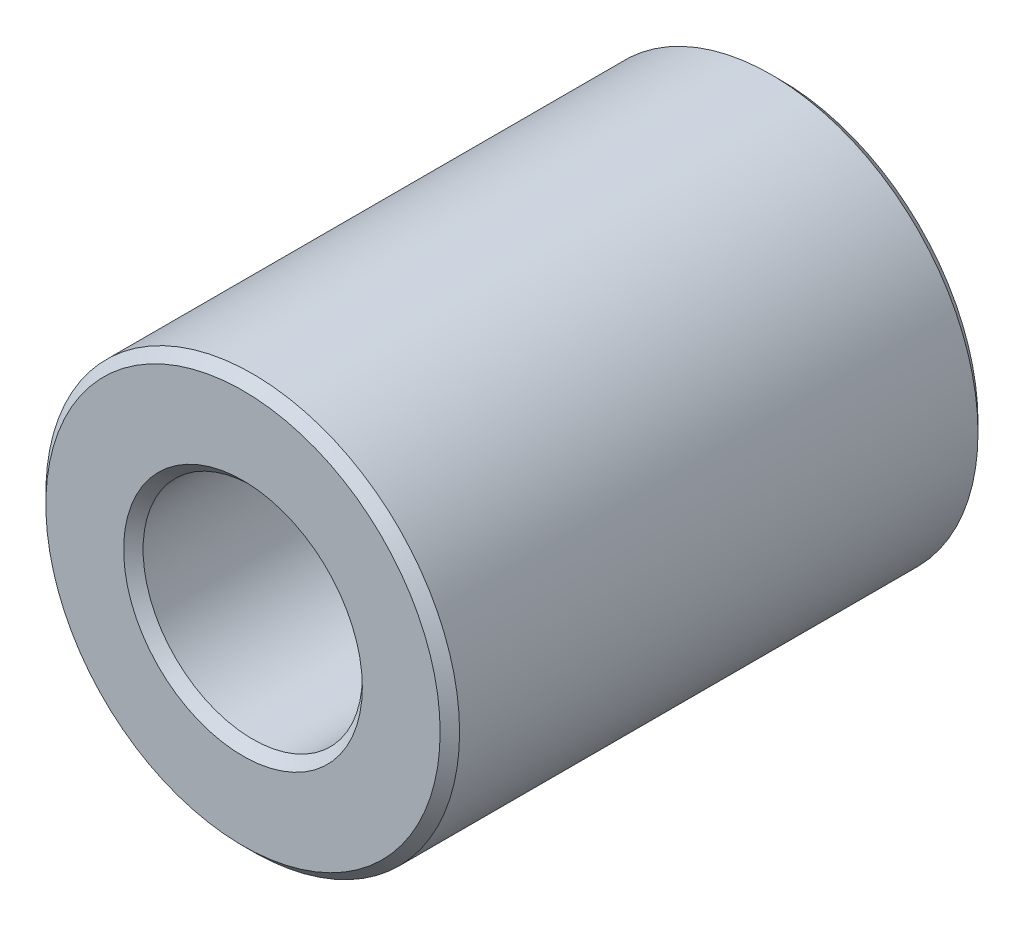
ISO-10303-21;
HEADER;
FILE_DESCRIPTION(('STEP AP214'),'2;1');
FILE_NAME('part.step','',(''),(''),'','','');
FILE_SCHEMA(('AUTOMOTIVE_DESIGN { 1 0 10303 214 1 1 1 1 }'));
ENDSEC;
DATA;
#1=APPLICATION_CONTEXT('core data for automotive mechanical design processes');
#2=APPLICATION_PROTOCOL_DEFINITION('international standard','automotive_design',2000,#1);
#3=PRODUCT_CONTEXT('',#1,'mechanical');
#4=PRODUCT('Part','Part','',(#3));
#5=PRODUCT_RELATED_PRODUCT_CATEGORY('part','',(#4));
#6=PRODUCT_DEFINITION_FORMATION('','',#4);
#7=PRODUCT_DEFINITION_CONTEXT('part definition',#1,'design');
#8=PRODUCT_DEFINITION('design','',#6,#7);
#9=PRODUCT_DEFINITION_SHAPE('','',#8);
#10=(LENGTH_UNIT() NAMED_UNIT(*) SI_UNIT(.MILLI.,.METRE.));
#11=(NAMED_UNIT(*) PLANE_ANGLE_UNIT() SI_UNIT($,.RADIAN.));
#12=(NAMED_UNIT(*) SI_UNIT($,.STERADIAN.) SOLID_ANGLE_UNIT());
#13=UNCERTAINTY_MEASURE_WITH_UNIT(LENGTH_MEASURE(1.E-05),#10,'distance_accuracy_value','');
#14=(GEOMETRIC_REPRESENTATION_CONTEXT(3) GLOBAL_UNCERTAINTY_ASSIGNED_CONTEXT((#13)) GLOBAL_UNIT_ASSIGNED_CONTEXT((#10,
#11,#12)) REPRESENTATION_CONTEXT('',''));
#15=CARTESIAN_POINT('',(0.,0.,0.));
#16=DIRECTION('',(0.,0.,1.));
#17=DIRECTION('',(1.,0.,0.));
#18=AXIS2_PLACEMENT_3D('',#15,#16,#17);
#19=CARTESIAN_POINT('',(0.,0.,-6.5));
#20=DIRECTION('',(0.,0.,1.));
#21=DIRECTION('',(1.,0.,0.));
#22=AXIS2_PLACEMENT_3D('',#19,#20,#21);
#23=CYLINDRICAL_SURFACE('',#22,5.);
#24=CARTESIAN_POINT('',(0.,0.,6.26500000000001));
#25=DIRECTION('',(0.,0.,1.));
#26=DIRECTION('',(1.,0.,0.));
#27=AXIS2_PLACEMENT_3D('',#24,#25,#26);
#28=CIRCLE('',#27,5.);
#29=CARTESIAN_POINT('',(5.,0.,6.265));
#30=VERTEX_POINT('',#29);
#31=EDGE_CURVE('E57',#30,#30,#28,.F.);
#32=CARTESIAN_POINT('',(0.,0.,-6.265));
#33=DIRECTION('',(0.,0.,1.));
#34=DIRECTION('',(1.,0.,0.));
#35=AXIS2_PLACEMENT_3D('',#32,#33,#34);
#36=CIRCLE('',#35,5.);
#37=CARTESIAN_POINT('',(5.,0.,-6.265));
#38=VERTEX_POINT('',#37);
#39=EDGE_CURVE('E60',#38,#38,#36,.T.);
#40=CARTESIAN_POINT('',(5.,0.,6.265));
#41=CARTESIAN_POINT('',(5.,0.,6.13447916666667));
#42=CARTESIAN_POINT('',(5.,0.,6.00395833333334));
#43=CARTESIAN_POINT('',(5.,0.,5.74291666666667));
#44=CARTESIAN_POINT('',(5.,0.,5.61239583333334));
#45=CARTESIAN_POINT('',(5.,0.,5.35135416666667));
#46=CARTESIAN_POINT('',(5.,0.,5.22083333333334));
#47=CARTESIAN_POINT('',(5.,0.,4.95979166666667));
#48=CARTESIAN_POINT('',(5.,0.,4.82927083333334));
#49=CARTESIAN_POINT('',(5.,0.,4.56822916666667));
#50=CARTESIAN_POINT('',(5.,0.,4.43770833333334));
#51=CARTESIAN_POINT('',(5.,0.,4.17666666666667));
#52=CARTESIAN_POINT('',(5.,0.,4.04614583333334));
#53=CARTESIAN_POINT('',(5.,0.,3.78510416666667));
#54=CARTESIAN_POINT('',(5.,0.,3.65458333333334));
#55=CARTESIAN_POINT('',(5.,0.,3.39354166666667));
#56=CARTESIAN_POINT('',(5.,0.,3.26302083333334));
#57=CARTESIAN_POINT('',(5.,0.,3.00197916666667));
#58=CARTESIAN_POINT('',(5.,0.,2.87145833333334));
#59=CARTESIAN_POINT('',(5.,0.,2.61041666666667));
#60=CARTESIAN_POINT('',(5.,0.,2.47989583333334));
#61=CARTESIAN_POINT('',(5.,0.,2.21885416666667));
#62=CARTESIAN_POINT('',(5.,0.,2.08833333333334));
#63=CARTESIAN_POINT('',(5.,0.,1.82729166666667));
#64=CARTESIAN_POINT('',(5.,0.,1.69677083333334));
#65=CARTESIAN_POINT('',(5.,0.,1.43572916666667));
#66=CARTESIAN_POINT('',(5.,0.,1.30520833333334));
#67=CARTESIAN_POINT('',(5.,0.,1.04416666666667));
#68=CARTESIAN_POINT('',(5.,0.,0.913645833333338));
#69=CARTESIAN_POINT('',(5.,0.,0.652604166666671));
#70=CARTESIAN_POINT('',(5.,0.,0.522083333333338));
#71=CARTESIAN_POINT('',(5.,0.,0.261041666666671));
#72=CARTESIAN_POINT('',(5.,0.,0.130520833333338));
#73=CARTESIAN_POINT('',(5.,0.,-0.130520833333329));
#74=CARTESIAN_POINT('',(5.,0.,-0.261041666666663));
#75=CARTESIAN_POINT('',(5.,0.,-0.522083333333329));
#76=CARTESIAN_POINT('',(5.,0.,-0.652604166666662));
#77=CARTESIAN_POINT('',(5.,0.,-0.913645833333329));
#78=CARTESIAN_POINT('',(5.,0.,-1.04416666666666));
#79=CARTESIAN_POINT('',(5.,0.,-1.30520833333333));
#80=CARTESIAN_POINT('',(5.,0.,-1.43572916666666));
#81=CARTESIAN_POINT('',(5.,0.,-1.69677083333333));
#82=CARTESIAN_POINT('',(5.,0.,-1.82729166666666));
#83=CARTESIAN_POINT('',(5.,0.,-2.08833333333333));
#84=CARTESIAN_POINT('',(5.,0.,-2.21885416666666));
#85=CARTESIAN_POINT('',(5.,0.,-2.47989583333333));
#86=CARTESIAN_POINT('',(5.,0.,-2.61041666666666));
#87=CARTESIAN_POINT('',(5.,0.,-2.87145833333333));
#88=CARTESIAN_POINT('',(5.,0.,-3.00197916666666));
#89=CARTESIAN_POINT('',(5.,0.,-3.26302083333333));
#90=CARTESIAN_POINT('',(5.,0.,-3.39354166666666));
#91=CARTESIAN_POINT('',(5.,0.,-3.65458333333333));
#92=CARTESIAN_POINT('',(5.,0.,-3.78510416666666));
#93=CARTESIAN_POINT('',(5.,0.,-4.04614583333333));
#94=CARTESIAN_POINT('',(5.,0.,-4.17666666666666));
#95=CARTESIAN_POINT('',(5.,0.,-4.43770833333333));
#96=CARTESIAN_POINT('',(5.,0.,-4.56822916666666));
#97=CARTESIAN_POINT('',(5.,0.,-4.82927083333333));
#98=CARTESIAN_POINT('',(5.,0.,-4.95979166666666));
#99=CARTESIAN_POINT('',(5.,0.,-5.22083333333333));
#100=CARTESIAN_POINT('',(5.,0.,-5.35135416666666));
#101=CARTESIAN_POINT('',(5.,0.,-5.61239583333333));
#102=CARTESIAN_POINT('',(5.,0.,-5.74291666666666));
#103=CARTESIAN_POINT('',(5.,0.,-6.00395833333333));
#104=CARTESIAN_POINT('',(5.,0.,-6.13447916666666));
#105=CARTESIAN_POINT('',(5.,0.,-6.265));
#106=B_SPLINE_CURVE_WITH_KNOTS('',3,(#40,#41,#42,#43,#44,#45,#46,#47,#48,#49,#50,#51,#52,#53,
#54,#55,#56,#57,#58,#59,#60,#61,#62,#63,#64,#65,#66,#67,#68,#69,#70,#71,#72,#73,#74,#75,#76,#77,
#78,#79,#80,#81,#82,#83,#84,#85,#86,#87,#88,#89,#90,#91,#92,#93,#94,#95,#96,#97,#98,#99,#100,
#101,#102,#103,#104,#105),.UNSPECIFIED.,.F.,.F.,(4,2,2,2,2,2,2,2,2,2,2,2,2,2,2,2,2,2,2,2,2,2,2,
2,2,2,2,2,2,2,2,2,4),(0.,0.3915625,0.783125000000001,1.1746875,1.56625,1.9578125,2.349375,
2.7409375,3.1325,3.5240625,3.915625,4.3071875,4.69875,5.0903125,5.481875,5.8734375,6.265,
6.6565625,7.048125,7.4396875,7.83125,8.2228125,8.614375,9.0059375,9.3975,9.7890625,10.180625,
10.5721875,10.96375,11.3553125,11.746875,12.1384375,12.53),.UNSPECIFIED.);
#107=EDGE_CURVE('BSEAM37',#30,#38,#106,.T.);
#108=ORIENTED_EDGE('',*,*,#31,.T.);
#109=ORIENTED_EDGE('',*,*,#39,.T.);
#110=ORIENTED_EDGE('',*,*,#107,.T.);
#111=ORIENTED_EDGE('',*,*,#107,.F.);
#112=EDGE_LOOP('',(#108,#110,#109,#111));
#113=FACE_BOUND('',#112,.T.);
#114=ADVANCED_FACE('F37',(#113),#23,.T.);
#115=CARTESIAN_POINT('',(0.,0.,-6.5));
#116=DIRECTION('',(0.,0.,1.));
#117=DIRECTION('',(1.,0.,0.));
#118=AXIS2_PLACEMENT_3D('',#115,#116,#117);
#119=PLANE('',#118);
#120=CARTESIAN_POINT('',(0.,0.,-6.5));
#121=DIRECTION('',(0.,0.,1.));
#122=DIRECTION('',(1.,0.,0.));
#123=AXIS2_PLACEMENT_3D('',#120,#121,#122);
#124=CIRCLE('',#123,4.76499999999999);
#125=CARTESIAN_POINT('',(4.76499999999999,0.,-6.5));
#126=VERTEX_POINT('',#125);
#127=EDGE_CURVE('E48',#126,#126,#124,.F.);
#128=ORIENTED_EDGE('',*,*,#127,.T.);
#129=EDGE_LOOP('',(#128));
#130=FACE_BOUND('',#129,.T.);
#131=CARTESIAN_POINT('',(0.,0.,-6.5));
#132=DIRECTION('',(0.,0.,1.));
#133=DIRECTION('',(1.,0.,0.));
#134=AXIS2_PLACEMENT_3D('',#131,#132,#133);
#135=CIRCLE('',#134,2.88499999999999);
#136=CARTESIAN_POINT('',(2.88499999999999,0.,-6.5));
#137=VERTEX_POINT('',#136);
#138=EDGE_CURVE('E52',#137,#137,#135,.T.);
#139=ORIENTED_EDGE('',*,*,#138,.T.);
#140=EDGE_LOOP('',(#139));
#141=FACE_BOUND('',#140,.T.);
#142=ADVANCED_FACE('F85',(#130,#141),#119,.F.);
#143=CARTESIAN_POINT('',(0.,0.,-6.5));
#144=DIRECTION('',(0.,0.,1.));
#145=DIRECTION('',(1.,0.,0.));
#146=AXIS2_PLACEMENT_3D('',#143,#144,#145);
#147=CYLINDRICAL_SURFACE('',#146,2.65);
#148=CARTESIAN_POINT('',(0.,0.,6.26499999999999));
#149=DIRECTION('',(0.,0.,1.));
#150=DIRECTION('',(1.,0.,0.));
#151=AXIS2_PLACEMENT_3D('',#148,#149,#150);
#152=CIRCLE('',#151,2.65);
#153=CARTESIAN_POINT('',(2.65,0.,6.26499999999999));
#154=VERTEX_POINT('',#153);
#155=EDGE_CURVE('E10',#154,#154,#152,.T.);
#156=CARTESIAN_POINT('',(0.,0.,-6.26500000000001));
#157=DIRECTION('',(0.,0.,1.));
#158=DIRECTION('',(1.,0.,0.));
#159=AXIS2_PLACEMENT_3D('',#156,#157,#158);
#160=CIRCLE('',#159,2.65);
#161=CARTESIAN_POINT('',(2.65,0.,-6.26500000000001));
#162=VERTEX_POINT('',#161);
#163=EDGE_CURVE('E44',#162,#162,#160,.F.);
#164=CARTESIAN_POINT('',(2.65,0.,6.26499999999999));
#165=CARTESIAN_POINT('',(2.65,0.,6.13447916666666));
#166=CARTESIAN_POINT('',(2.65,0.,6.00395833333332));
#167=CARTESIAN_POINT('',(2.65,0.,5.74291666666666));
#168=CARTESIAN_POINT('',(2.65,0.,5.61239583333332));
#169=CARTESIAN_POINT('',(2.65,0.,5.35135416666666));
#170=CARTESIAN_POINT('',(2.65,0.,5.22083333333332));
#171=CARTESIAN_POINT('',(2.65,0.,4.95979166666666));
#172=CARTESIAN_POINT('',(2.65,0.,4.82927083333332));
#173=CARTESIAN_POINT('',(2.65,0.,4.56822916666666));
#174=CARTESIAN_POINT('',(2.65,0.,4.43770833333332));
#175=CARTESIAN_POINT('',(2.65,0.,4.17666666666666));
#176=CARTESIAN_POINT('',(2.65,0.,4.04614583333332));
#177=CARTESIAN_POINT('',(2.65,0.,3.78510416666666));
#178=CARTESIAN_POINT('',(2.65,0.,3.65458333333332));
#179=CARTESIAN_POINT('',(2.65,0.,3.39354166666666));
#180=CARTESIAN_POINT('',(2.65,0.,3.26302083333332));
#181=CARTESIAN_POINT('',(2.65,0.,3.00197916666666));
#182=CARTESIAN_POINT('',(2.65,0.,2.87145833333332));
#183=CARTESIAN_POINT('',(2.65,0.,2.61041666666666));
#184=CARTESIAN_POINT('',(2.65,0.,2.47989583333332));
#185=CARTESIAN_POINT('',(2.65,0.,2.21885416666666));
#186=CARTESIAN_POINT('',(2.65,0.,2.08833333333332));
#187=CARTESIAN_POINT('',(2.65,0.,1.82729166666666));
#188=CARTESIAN_POINT('',(2.65,0.,1.69677083333332));
#189=CARTESIAN_POINT('',(2.65,0.,1.43572916666666));
#190=CARTESIAN_POINT('',(2.65,0.,1.30520833333332));
#191=CARTESIAN_POINT('',(2.65,0.,1.04416666666666));
#192=CARTESIAN_POINT('',(2.65,0.,0.913645833333324));
#193=CARTESIAN_POINT('',(2.65,0.,0.652604166666657));
#194=CARTESIAN_POINT('',(2.65,0.,0.522083333333324));
#195=CARTESIAN_POINT('',(2.65,0.,0.261041666666657));
#196=CARTESIAN_POINT('',(2.65,0.,0.130520833333324));
#197=CARTESIAN_POINT('',(2.65,0.,-0.130520833333343));
#198=CARTESIAN_POINT('',(2.65,0.,-0.261041666666676));
#199=CARTESIAN_POINT('',(2.65,0.,-0.522083333333343));
#200=CARTESIAN_POINT('',(2.65,0.,-0.652604166666676));
#201=CARTESIAN_POINT('',(2.65,0.,-0.913645833333343));
#202=CARTESIAN_POINT('',(2.65,0.,-1.04416666666668));
#203=CARTESIAN_POINT('',(2.65,0.,-1.30520833333334));
#204=CARTESIAN_POINT('',(2.65,0.,-1.43572916666668));
#205=CARTESIAN_POINT('',(2.65,0.,-1.69677083333334));
#206=CARTESIAN_POINT('',(2.65,0.,-1.82729166666668));
#207=CARTESIAN_POINT('',(2.65,0.,-2.08833333333334));
#208=CARTESIAN_POINT('',(2.65,0.,-2.21885416666668));
#209=CARTESIAN_POINT('',(2.65,0.,-2.47989583333334));
#210=CARTESIAN_POINT('',(2.65,0.,-2.61041666666668));
#211=CARTESIAN_POINT('',(2.65,0.,-2.87145833333334));
#212=CARTESIAN_POINT('',(2.65,0.,-3.00197916666668));
#213=CARTESIAN_POINT('',(2.65,0.,-3.26302083333334));
#214=CARTESIAN_POINT('',(2.65,0.,-3.39354166666668));
#215=CARTESIAN_POINT('',(2.65,0.,-3.65458333333334));
#216=CARTESIAN_POINT('',(2.65,0.,-3.78510416666668));
#217=CARTESIAN_POINT('',(2.65,0.,-4.04614583333334));
#218=CARTESIAN_POINT('',(2.65,0.,-4.17666666666668));
#219=CARTESIAN_POINT('',(2.65,0.,-4.43770833333334));
#220=CARTESIAN_POINT('',(2.65,0.,-4.56822916666668));
#221=CARTESIAN_POINT('',(2.65,0.,-4.82927083333334));
#222=CARTESIAN_POINT('',(2.65,0.,-4.95979166666668));
#223=CARTESIAN_POINT('',(2.65,0.,-5.22083333333334));
#224=CARTESIAN_POINT('',(2.65,0.,-5.35135416666667));
#225=CARTESIAN_POINT('',(2.65,0.,-5.61239583333334));
#226=CARTESIAN_POINT('',(2.65,0.,-5.74291666666668));
#227=CARTESIAN_POINT('',(2.65,0.,-6.00395833333334));
#228=CARTESIAN_POINT('',(2.65,0.,-6.13447916666668));
#229=CARTESIAN_POINT('',(2.65,0.,-6.26500000000001));
#230=B_SPLINE_CURVE_WITH_KNOTS('',3,(#164,#165,#166,#167,#168,#169,#170,#171,#172,#173,#174,
#175,#176,#177,#178,#179,#180,#181,#182,#183,#184,#185,#186,#187,#188,#189,#190,#191,#192,#193,
#194,#195,#196,#197,#198,#199,#200,#201,#202,#203,#204,#205,#206,#207,#208,#209,#210,#211,#212,
#213,#214,#215,#216,#217,#218,#219,#220,#221,#222,#223,#224,#225,#226,#227,#228,#229),
.UNSPECIFIED.,.F.,.F.,(4,2,2,2,2,2,2,2,2,2,2,2,2,2,2,2,2,2,2,2,2,2,2,2,2,2,2,2,2,2,2,2,4),(0.,
0.3915625,0.783125000000001,1.1746875,1.56625,1.9578125,2.349375,2.7409375,3.1325,3.5240625,
3.915625,4.3071875,4.69875,5.0903125,5.481875,5.8734375,6.265,6.6565625,7.048125,7.4396875,
7.83125,8.2228125,8.614375,9.0059375,9.3975,9.7890625,10.180625,10.5721875,10.96375,11.3553125,
11.746875,12.1384375,12.53),.UNSPECIFIED.);
#231=EDGE_CURVE('BSEAM91',#154,#162,#230,.T.);
#232=ORIENTED_EDGE('',*,*,#155,.T.);
#233=ORIENTED_EDGE('',*,*,#163,.T.);
#234=ORIENTED_EDGE('',*,*,#231,.T.);
#235=ORIENTED_EDGE('',*,*,#231,.F.);
#236=EDGE_LOOP('',(#232,#234,#233,#235));
#237=FACE_BOUND('',#236,.T.);
#238=ADVANCED_FACE('F91',(#237),#147,.F.);
#239=CARTESIAN_POINT('',(0.,0.,6.5));
#240=DIRECTION('',(0.,0.,1.));
#241=DIRECTION('',(1.,0.,0.));
#242=AXIS2_PLACEMENT_3D('',#239,#240,#241);
#243=PLANE('',#242);
#244=CARTESIAN_POINT('',(0.,0.,6.5));
#245=DIRECTION('',(0.,0.,1.));
#246=DIRECTION('',(1.,0.,0.));
#247=AXIS2_PLACEMENT_3D('',#244,#245,#246);
#248=CIRCLE('',#247,4.76500000000001);
#249=CARTESIAN_POINT('',(4.76500000000001,0.,6.5));
#250=VERTEX_POINT('',#249);
#251=EDGE_CURVE('E63',#250,#250,#248,.T.);
#252=ORIENTED_EDGE('',*,*,#251,.T.);
#253=EDGE_LOOP('',(#252));
#254=FACE_BOUND('',#253,.T.);
#255=CARTESIAN_POINT('',(0.,0.,6.5));
#256=DIRECTION('',(0.,0.,1.));
#257=DIRECTION('',(1.,0.,0.));
#258=AXIS2_PLACEMENT_3D('',#255,#256,#257);
#259=CIRCLE('',#258,2.88500000000001);
#260=CARTESIAN_POINT('',(2.88500000000001,0.,6.5));
#261=VERTEX_POINT('',#260);
#262=EDGE_CURVE('E66',#261,#261,#259,.F.);
#263=ORIENTED_EDGE('',*,*,#262,.T.);
#264=EDGE_LOOP('',(#263));
#265=FACE_BOUND('',#264,.T.);
#266=ADVANCED_FACE('F70',(#254,#265),#243,.T.);
#267=CARTESIAN_POINT('',(0.,0.,6.5));
#268=DIRECTION('',(0.,0.,-1.));
#269=DIRECTION('',(-1.,0.,0.));
#270=AXIS2_PLACEMENT_3D('',#267,#268,#269);
#271=CONICAL_SURFACE('',#270,4.76500000000001,0.785398163397448);
#272=ORIENTED_EDGE('',*,*,#31,.F.);
#273=EDGE_LOOP('',(#272));
#274=FACE_BOUND('',#273,.T.);
#275=ORIENTED_EDGE('',*,*,#251,.F.);
#276=EDGE_LOOP('',(#275));
#277=FACE_BOUND('',#276,.T.);
#278=ADVANCED_FACE('F81',(#274,#277),#271,.T.);
#279=CARTESIAN_POINT('',(0.,0.,-6.265));
#280=DIRECTION('',(0.,0.,1.));
#281=DIRECTION('',(1.,0.,0.));
#282=AXIS2_PLACEMENT_3D('',#279,#280,#281);
#283=CONICAL_SURFACE('',#282,5.,0.785398163397452);
#284=ORIENTED_EDGE('',*,*,#127,.F.);
#285=EDGE_LOOP('',(#284));
#286=FACE_BOUND('',#285,.T.);
#287=ORIENTED_EDGE('',*,*,#39,.F.);
#288=EDGE_LOOP('',(#287));
#289=FACE_BOUND('',#288,.T.);
#290=ADVANCED_FACE('F75',(#286,#289),#283,.T.);
#291=CARTESIAN_POINT('',(0.,0.,6.26499999999999));
#292=DIRECTION('',(0.,0.,1.));
#293=DIRECTION('',(1.,0.,0.));
#294=AXIS2_PLACEMENT_3D('',#291,#292,#293);
#295=CONICAL_SURFACE('',#294,2.65,0.785398163397446);
#296=ORIENTED_EDGE('',*,*,#262,.F.);
#297=EDGE_LOOP('',(#296));
#298=FACE_BOUND('',#297,.T.);
#299=ORIENTED_EDGE('',*,*,#155,.F.);
#300=EDGE_LOOP('',(#299));
#301=FACE_BOUND('',#300,.T.);
#302=ADVANCED_FACE('F72',(#298,#301),#295,.F.);
#303=CARTESIAN_POINT('',(0.,0.,-6.5));
#304=DIRECTION('',(0.,0.,-1.));
#305=DIRECTION('',(-1.,0.,0.));
#306=AXIS2_PLACEMENT_3D('',#303,#304,#305);
#307=CONICAL_SURFACE('',#306,2.88499999999999,0.785398163397446);
#308=ORIENTED_EDGE('',*,*,#163,.F.);
#309=EDGE_LOOP('',(#308));
#310=FACE_BOUND('',#309,.T.);
#311=ORIENTED_EDGE('',*,*,#138,.F.);
#312=EDGE_LOOP('',(#311));
#313=FACE_BOUND('',#312,.T.);
#314=ADVANCED_FACE('F39',(#310,#313),#307,.F.);
#315=CLOSED_SHELL('',(#114,#142,#238,#266,#278,#290,#302,#314));
#316=MANIFOLD_SOLID_BREP('B2',#315);
#317=ADVANCED_BREP_SHAPE_REPRESENTATION('',(#18,#316),#14);
#318=SHAPE_DEFINITION_REPRESENTATION(#9,#317);
ENDSEC;
END-ISO-10303-21;
